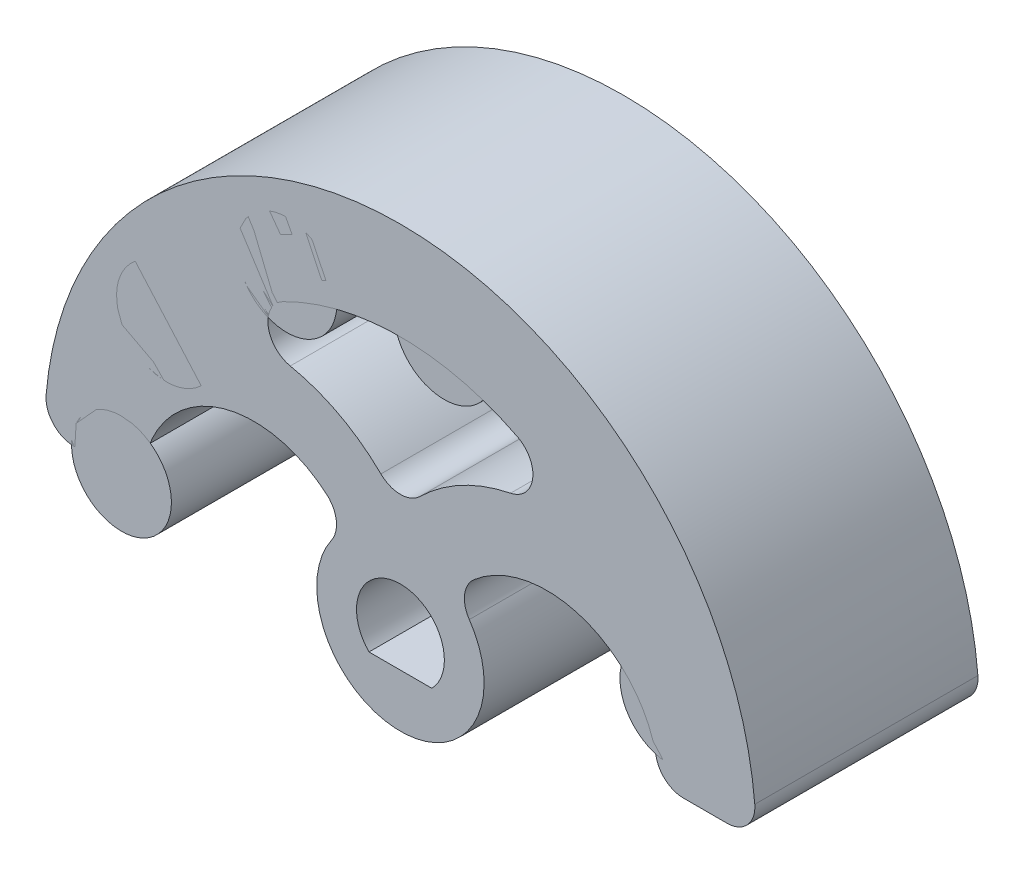
ISO-10303-21;
HEADER;
FILE_DESCRIPTION(('STEP AP214'),'2;1');
FILE_NAME('part.step','',(''),(''),'','','');
FILE_SCHEMA(('AUTOMOTIVE_DESIGN { 1 0 10303 214 1 1 1 1 }'));
ENDSEC;
DATA;
#1=APPLICATION_CONTEXT('core data for automotive mechanical design processes');
#2=APPLICATION_PROTOCOL_DEFINITION('international standard','automotive_design',2000,#1);
#3=PRODUCT_CONTEXT('',#1,'mechanical');
#4=PRODUCT('Part','Part','',(#3));
#5=PRODUCT_RELATED_PRODUCT_CATEGORY('part','',(#4));
#6=PRODUCT_DEFINITION_FORMATION('','',#4);
#7=PRODUCT_DEFINITION_CONTEXT('part definition',#1,'design');
#8=PRODUCT_DEFINITION('design','',#6,#7);
#9=PRODUCT_DEFINITION_SHAPE('','',#8);
#10=(LENGTH_UNIT() NAMED_UNIT(*) SI_UNIT(.MILLI.,.METRE.));
#11=(NAMED_UNIT(*) PLANE_ANGLE_UNIT() SI_UNIT($,.RADIAN.));
#12=(NAMED_UNIT(*) SI_UNIT($,.STERADIAN.) SOLID_ANGLE_UNIT());
#13=UNCERTAINTY_MEASURE_WITH_UNIT(LENGTH_MEASURE(1.E-05),#10,'distance_accuracy_value','');
#14=(GEOMETRIC_REPRESENTATION_CONTEXT(3) GLOBAL_UNCERTAINTY_ASSIGNED_CONTEXT((#13)) GLOBAL_UNIT_ASSIGNED_CONTEXT((#10,
#11,#12)) REPRESENTATION_CONTEXT('',''));
#15=CARTESIAN_POINT('',(0.,0.,0.));
#16=DIRECTION('',(0.,0.,1.));
#17=DIRECTION('',(1.,0.,0.));
#18=AXIS2_PLACEMENT_3D('',#15,#16,#17);
#19=CARTESIAN_POINT('',(9.6592582628907,2.58819045102516,0.));
#20=DIRECTION('',(0.,0.,1.));
#21=DIRECTION('',(-0.96592582628907,-0.258819045102516,0.));
#22=AXIS2_PLACEMENT_3D('',#19,#20,#21);
#23=CYLINDRICAL_SURFACE('',#22,1.78981093410736);
#24=CARTESIAN_POINT('',(9.6592582628907,2.58819045102516,0.));
#25=DIRECTION('',(0.,0.,1.));
#26=DIRECTION('',(-0.96592582628907,-0.258819045102516,0.));
#27=AXIS2_PLACEMENT_3D('',#24,#25,#26);
#28=CIRCLE('',#27,1.78981093410736);
#29=CARTESIAN_POINT('',(7.93043365746183,2.12495329414545,0.));
#30=VERTEX_POINT('',#29);
#31=EDGE_CURVE('P0_E11',#30,#30,#28,.T.);
#32=ORIENTED_EDGE('',*,*,#31,.T.);
#33=EDGE_LOOP('',(#32));
#34=FACE_BOUND('',#33,.T.);
#35=CARTESIAN_POINT('',(9.6592582628907,2.58819045102516,8.));
#36=DIRECTION('',(0.,0.,1.));
#37=DIRECTION('',(-0.96592582628907,-0.258819045102516,0.));
#38=AXIS2_PLACEMENT_3D('',#35,#36,#37);
#39=CIRCLE('',#38,1.78981093410736);
#40=CARTESIAN_POINT('',(7.93043365746183,2.12495329414545,8.));
#41=VERTEX_POINT('',#40);
#42=EDGE_CURVE('P0_E51',#41,#41,#39,.T.);
#43=ORIENTED_EDGE('',*,*,#42,.F.);
#44=EDGE_LOOP('',(#43));
#45=FACE_BOUND('',#44,.T.);
#46=ADVANCED_FACE('P0_F48',(#34,#45),#23,.T.);
#47=CARTESIAN_POINT('',(0.,0.,0.));
#48=DIRECTION('',(0.,0.,1.));
#49=DIRECTION('',(-0.96592582628907,-0.258819045102516,0.));
#50=AXIS2_PLACEMENT_3D('',#47,#48,#49);
#51=PLANE('',#50);
#52=ORIENTED_EDGE('',*,*,#31,.F.);
#53=EDGE_LOOP('',(#52));
#54=FACE_BOUND('',#53,.T.);
#55=ADVANCED_FACE('P0_F63',(#54),#51,.F.);
#56=CARTESIAN_POINT('',(0.,0.,8.));
#57=DIRECTION('',(0.,0.,1.));
#58=DIRECTION('',(-0.96592582628907,-0.258819045102516,0.));
#59=AXIS2_PLACEMENT_3D('',#56,#57,#58);
#60=PLANE('',#59);
#61=ORIENTED_EDGE('',*,*,#42,.T.);
#62=EDGE_LOOP('',(#61));
#63=FACE_BOUND('',#62,.T.);
#64=ADVANCED_FACE('P0_F60',(#63),#60,.T.);
#65=CLOSED_SHELL('',(#46,#55,#64));
#66=MANIFOLD_SOLID_BREP('P0_B2',#65);
#67=CARTESIAN_POINT('',(6.69130606358861,7.43144825477392,0.));
#68=DIRECTION('',(0.,0.,1.));
#69=DIRECTION('',(-0.669130606358861,-0.743144825477392,0.));
#70=AXIS2_PLACEMENT_3D('',#67,#68,#69);
#71=CYLINDRICAL_SURFACE('',#70,1.78981093410736);
#72=CARTESIAN_POINT('',(6.69130606358861,7.43144825477392,0.));
#73=DIRECTION('',(0.,0.,1.));
#74=DIRECTION('',(-0.669130606358861,-0.743144825477392,0.));
#75=AXIS2_PLACEMENT_3D('',#72,#73,#74);
#76=CIRCLE('',#75,1.78981093410736);
#77=CARTESIAN_POINT('',(5.49368878798163,6.10135952050917,0.));
#78=VERTEX_POINT('',#77);
#79=EDGE_CURVE('P0_E47',#78,#78,#76,.T.);
#80=ORIENTED_EDGE('',*,*,#79,.T.);
#81=EDGE_LOOP('',(#80));
#82=FACE_BOUND('',#81,.T.);
#83=CARTESIAN_POINT('',(6.69130606358861,7.43144825477392,8.));
#84=DIRECTION('',(0.,0.,1.));
#85=DIRECTION('',(-0.669130606358861,-0.743144825477392,0.));
#86=AXIS2_PLACEMENT_3D('',#83,#84,#85);
#87=CIRCLE('',#86,1.78981093410736);
#88=CARTESIAN_POINT('',(5.49368878798163,6.10135952050917,8.));
#89=VERTEX_POINT('',#88);
#90=EDGE_CURVE('P0_E128',#89,#89,#87,.T.);
#91=ORIENTED_EDGE('',*,*,#90,.F.);
#92=EDGE_LOOP('',(#91));
#93=FACE_BOUND('',#92,.T.);
#94=ADVANCED_FACE('P0_F125',(#82,#93),#71,.T.);
#95=CARTESIAN_POINT('',(0.,0.,0.));
#96=DIRECTION('',(0.,0.,1.));
#97=DIRECTION('',(-0.669130606358861,-0.743144825477392,0.));
#98=AXIS2_PLACEMENT_3D('',#95,#96,#97);
#99=PLANE('',#98);
#100=ORIENTED_EDGE('',*,*,#79,.F.);
#101=EDGE_LOOP('',(#100));
#102=FACE_BOUND('',#101,.T.);
#103=ADVANCED_FACE('P0_F140',(#102),#99,.F.);
#104=CARTESIAN_POINT('',(0.,0.,8.));
#105=DIRECTION('',(0.,0.,1.));
#106=DIRECTION('',(-0.669130606358861,-0.743144825477392,0.));
#107=AXIS2_PLACEMENT_3D('',#104,#105,#106);
#108=PLANE('',#107);
#109=ORIENTED_EDGE('',*,*,#90,.T.);
#110=EDGE_LOOP('',(#109));
#111=FACE_BOUND('',#110,.T.);
#112=ADVANCED_FACE('P0_F137',(#111),#108,.T.);
#113=CLOSED_SHELL('',(#94,#103,#112));
#114=MANIFOLD_SOLID_BREP('P0_B6',#113);
#115=CARTESIAN_POINT('',(1.56434465040234,9.87688340595137,0.));
#116=DIRECTION('',(0.,0.,1.));
#117=DIRECTION('',(-0.156434465040234,-0.987688340595137,0.));
#118=AXIS2_PLACEMENT_3D('',#115,#116,#117);
#119=CYLINDRICAL_SURFACE('',#118,1.78981093410736);
#120=CARTESIAN_POINT('',(1.56434465040234,9.87688340595137,0.));
#121=DIRECTION('',(0.,0.,1.));
#122=DIRECTION('',(-0.156434465040234,-0.987688340595137,0.));
#123=AXIS2_PLACEMENT_3D('',#120,#121,#122);
#124=CIRCLE('',#123,1.78981093410736);
#125=CARTESIAN_POINT('',(1.28435653440209,8.10910801446384,0.));
#126=VERTEX_POINT('',#125);
#127=EDGE_CURVE('P0_E124',#126,#126,#124,.T.);
#128=ORIENTED_EDGE('',*,*,#127,.T.);
#129=EDGE_LOOP('',(#128));
#130=FACE_BOUND('',#129,.T.);
#131=CARTESIAN_POINT('',(1.56434465040234,9.87688340595137,8.));
#132=DIRECTION('',(0.,0.,1.));
#133=DIRECTION('',(-0.156434465040234,-0.987688340595137,0.));
#134=AXIS2_PLACEMENT_3D('',#131,#132,#133);
#135=CIRCLE('',#134,1.78981093410736);
#136=CARTESIAN_POINT('',(1.28435653440209,8.10910801446384,8.));
#137=VERTEX_POINT('',#136);
#138=EDGE_CURVE('P0_E205',#137,#137,#135,.T.);
#139=ORIENTED_EDGE('',*,*,#138,.F.);
#140=EDGE_LOOP('',(#139));
#141=FACE_BOUND('',#140,.T.);
#142=ADVANCED_FACE('P0_F202',(#130,#141),#119,.T.);
#143=CARTESIAN_POINT('',(0.,0.,0.));
#144=DIRECTION('',(0.,0.,1.));
#145=DIRECTION('',(-0.156434465040234,-0.987688340595137,0.));
#146=AXIS2_PLACEMENT_3D('',#143,#144,#145);
#147=PLANE('',#146);
#148=ORIENTED_EDGE('',*,*,#127,.F.);
#149=EDGE_LOOP('',(#148));
#150=FACE_BOUND('',#149,.T.);
#151=ADVANCED_FACE('P0_F217',(#150),#147,.F.);
#152=CARTESIAN_POINT('',(0.,0.,8.));
#153=DIRECTION('',(0.,0.,1.));
#154=DIRECTION('',(-0.156434465040234,-0.987688340595137,0.));
#155=AXIS2_PLACEMENT_3D('',#152,#153,#154);
#156=PLANE('',#155);
#157=ORIENTED_EDGE('',*,*,#138,.T.);
#158=EDGE_LOOP('',(#157));
#159=FACE_BOUND('',#158,.T.);
#160=ADVANCED_FACE('P0_F214',(#159),#156,.T.);
#161=CLOSED_SHELL('',(#142,#151,#160));
#162=MANIFOLD_SOLID_BREP('P0_B42',#161);
#163=CARTESIAN_POINT('',(-4.06736643075798,9.13545457642602,0.));
#164=DIRECTION('',(0.,0.,1.));
#165=DIRECTION('',(0.406736643075798,-0.913545457642602,0.));
#166=AXIS2_PLACEMENT_3D('',#163,#164,#165);
#167=CYLINDRICAL_SURFACE('',#166,1.78981093410736);
#168=CARTESIAN_POINT('',(-4.06736643075798,9.13545457642602,0.));
#169=DIRECTION('',(0.,0.,1.));
#170=DIRECTION('',(0.406736643075798,-0.913545457642602,0.));
#171=AXIS2_PLACEMENT_3D('',#168,#169,#170);
#172=CIRCLE('',#171,1.78981093410736);
#173=CARTESIAN_POINT('',(-3.3393847396788,7.50038092753317,0.));
#174=VERTEX_POINT('',#173);
#175=EDGE_CURVE('P0_E201',#174,#174,#172,.T.);
#176=ORIENTED_EDGE('',*,*,#175,.T.);
#177=EDGE_LOOP('',(#176));
#178=FACE_BOUND('',#177,.T.);
#179=CARTESIAN_POINT('',(-4.06736643075798,9.13545457642602,8.));
#180=DIRECTION('',(0.,0.,1.));
#181=DIRECTION('',(0.406736643075798,-0.913545457642602,0.));
#182=AXIS2_PLACEMENT_3D('',#179,#180,#181);
#183=CIRCLE('',#182,1.78981093410736);
#184=CARTESIAN_POINT('',(-3.3393847396788,7.50038092753317,8.));
#185=VERTEX_POINT('',#184);
#186=EDGE_CURVE('P0_E282',#185,#185,#183,.T.);
#187=ORIENTED_EDGE('',*,*,#186,.F.);
#188=EDGE_LOOP('',(#187));
#189=FACE_BOUND('',#188,.T.);
#190=ADVANCED_FACE('P0_F279',(#178,#189),#167,.T.);
#191=CARTESIAN_POINT('',(0.,0.,0.));
#192=DIRECTION('',(0.,0.,1.));
#193=DIRECTION('',(0.406736643075798,-0.913545457642602,0.));
#194=AXIS2_PLACEMENT_3D('',#191,#192,#193);
#195=PLANE('',#194);
#196=ORIENTED_EDGE('',*,*,#175,.F.);
#197=EDGE_LOOP('',(#196));
#198=FACE_BOUND('',#197,.T.);
#199=ADVANCED_FACE('P0_F294',(#198),#195,.F.);
#200=CARTESIAN_POINT('',(0.,0.,8.));
#201=DIRECTION('',(0.,0.,1.));
#202=DIRECTION('',(0.406736643075798,-0.913545457642602,0.));
#203=AXIS2_PLACEMENT_3D('',#200,#201,#202);
#204=PLANE('',#203);
#205=ORIENTED_EDGE('',*,*,#186,.T.);
#206=EDGE_LOOP('',(#205));
#207=FACE_BOUND('',#206,.T.);
#208=ADVANCED_FACE('P0_F291',(#207),#204,.T.);
#209=CLOSED_SHELL('',(#190,#199,#208));
#210=MANIFOLD_SOLID_BREP('P0_B119',#209);
#211=CARTESIAN_POINT('',(-8.38670567945424,5.44639035015028,0.));
#212=DIRECTION('',(0.,0.,1.));
#213=DIRECTION('',(0.838670567945423,-0.544639035015028,0.));
#214=AXIS2_PLACEMENT_3D('',#211,#212,#213);
#215=CYLINDRICAL_SURFACE('',#214,1.78981093410736);
#216=CARTESIAN_POINT('',(-8.38670567945424,5.44639035015028,0.));
#217=DIRECTION('',(0.,0.,1.));
#218=DIRECTION('',(0.838670567945423,-0.544639035015028,0.));
#219=AXIS2_PLACEMENT_3D('',#216,#217,#218);
#220=CIRCLE('',#219,1.78981093410736);
#221=CARTESIAN_POINT('',(-6.88564392683148,4.4715894501387,0.));
#222=VERTEX_POINT('',#221);
#223=EDGE_CURVE('P0_E278',#222,#222,#220,.T.);
#224=ORIENTED_EDGE('',*,*,#223,.T.);
#225=EDGE_LOOP('',(#224));
#226=FACE_BOUND('',#225,.T.);
#227=CARTESIAN_POINT('',(-8.38670567945424,5.44639035015028,8.));
#228=DIRECTION('',(0.,0.,1.));
#229=DIRECTION('',(0.838670567945423,-0.544639035015028,0.));
#230=AXIS2_PLACEMENT_3D('',#227,#228,#229);
#231=CIRCLE('',#230,1.78981093410736);
#232=CARTESIAN_POINT('',(-6.88564392683148,4.4715894501387,8.));
#233=VERTEX_POINT('',#232);
#234=EDGE_CURVE('P0_E358',#233,#233,#231,.T.);
#235=ORIENTED_EDGE('',*,*,#234,.F.);
#236=EDGE_LOOP('',(#235));
#237=FACE_BOUND('',#236,.T.);
#238=ADVANCED_FACE('P0_F355',(#226,#237),#215,.T.);
#239=CARTESIAN_POINT('',(0.,0.,0.));
#240=DIRECTION('',(0.,0.,1.));
#241=DIRECTION('',(0.838670567945423,-0.544639035015028,0.));
#242=AXIS2_PLACEMENT_3D('',#239,#240,#241);
#243=PLANE('',#242);
#244=ORIENTED_EDGE('',*,*,#223,.F.);
#245=EDGE_LOOP('',(#244));
#246=FACE_BOUND('',#245,.T.);
#247=ADVANCED_FACE('P0_F370',(#246),#243,.F.);
#248=CARTESIAN_POINT('',(0.,0.,8.));
#249=DIRECTION('',(0.,0.,1.));
#250=DIRECTION('',(0.838670567945423,-0.544639035015028,0.));
#251=AXIS2_PLACEMENT_3D('',#248,#249,#250);
#252=PLANE('',#251);
#253=ORIENTED_EDGE('',*,*,#234,.T.);
#254=EDGE_LOOP('',(#253));
#255=FACE_BOUND('',#254,.T.);
#256=ADVANCED_FACE('P0_F367',(#255),#252,.T.);
#257=CLOSED_SHELL('',(#238,#247,#256));
#258=MANIFOLD_SOLID_BREP('P0_B196',#257);
#259=CARTESIAN_POINT('',(-10.,0.,0.));
#260=DIRECTION('',(0.,0.,1.));
#261=DIRECTION('',(1.,0.,0.));
#262=AXIS2_PLACEMENT_3D('',#259,#260,#261);
#263=CYLINDRICAL_SURFACE('',#262,1.78981093410736);
#264=CARTESIAN_POINT('',(-10.,0.,0.));
#265=DIRECTION('',(0.,0.,1.));
#266=DIRECTION('',(1.,0.,0.));
#267=AXIS2_PLACEMENT_3D('',#264,#265,#266);
#268=CIRCLE('',#267,1.78981093410736);
#269=CARTESIAN_POINT('',(-8.21018906589264,0.,0.));
#270=VERTEX_POINT('',#269);
#271=EDGE_CURVE('P0_E354',#270,#270,#268,.T.);
#272=ORIENTED_EDGE('',*,*,#271,.T.);
#273=EDGE_LOOP('',(#272));
#274=FACE_BOUND('',#273,.T.);
#275=CARTESIAN_POINT('',(-10.,0.,8.));
#276=DIRECTION('',(0.,0.,1.));
#277=DIRECTION('',(1.,0.,0.));
#278=AXIS2_PLACEMENT_3D('',#275,#276,#277);
#279=CIRCLE('',#278,1.78981093410736);
#280=CARTESIAN_POINT('',(-8.21018906589264,0.,8.));
#281=VERTEX_POINT('',#280);
#282=EDGE_CURVE('P0_E427',#281,#281,#279,.T.);
#283=ORIENTED_EDGE('',*,*,#282,.F.);
#284=EDGE_LOOP('',(#283));
#285=FACE_BOUND('',#284,.T.);
#286=ADVANCED_FACE('P0_F424',(#274,#285),#263,.T.);
#287=CARTESIAN_POINT('',(0.,0.,0.));
#288=DIRECTION('',(0.,0.,1.));
#289=DIRECTION('',(1.,0.,0.));
#290=AXIS2_PLACEMENT_3D('',#287,#288,#289);
#291=PLANE('',#290);
#292=ORIENTED_EDGE('',*,*,#271,.F.);
#293=EDGE_LOOP('',(#292));
#294=FACE_BOUND('',#293,.T.);
#295=ADVANCED_FACE('P0_F439',(#294),#291,.F.);
#296=CARTESIAN_POINT('',(0.,0.,8.));
#297=DIRECTION('',(0.,0.,1.));
#298=DIRECTION('',(1.,0.,0.));
#299=AXIS2_PLACEMENT_3D('',#296,#297,#298);
#300=PLANE('',#299);
#301=ORIENTED_EDGE('',*,*,#282,.T.);
#302=EDGE_LOOP('',(#301));
#303=FACE_BOUND('',#302,.T.);
#304=ADVANCED_FACE('P0_F436',(#303),#300,.T.);
#305=CLOSED_SHELL('',(#286,#295,#304));
#306=MANIFOLD_SOLID_BREP('P0_B273',#305);
#307=CARTESIAN_POINT('',(11.7073694739681,1.,8.));
#308=DIRECTION('',(0.,0.,1.));
#309=DIRECTION('',(1.,0.,0.));
#310=AXIS2_PLACEMENT_3D('',#307,#308,#309);
#311=CYLINDRICAL_SURFACE('',#310,1.);
#312=CARTESIAN_POINT('',(11.7073694739681,1.,8.));
#313=DIRECTION('',(0.,0.,-1.));
#314=DIRECTION('',(0.,-1.,0.));
#315=AXIS2_PLACEMENT_3D('',#312,#313,#314);
#316=CIRCLE('',#315,1.);
#317=CARTESIAN_POINT('',(12.703741344093,1.08510638297872,8.));
#318=VERTEX_POINT('',#317);
#319=CARTESIAN_POINT('',(11.7073694739681,0.,8.));
#320=VERTEX_POINT('',#319);
#321=EDGE_CURVE('P1_E11',#318,#320,#316,.T.);
#322=ORIENTED_EDGE('',*,*,#321,.T.);
#323=DIRECTION('',(0.,0.,-1.));
#324=VECTOR('',#323,1.);
#325=CARTESIAN_POINT('',(11.7073694739681,0.,8.));
#326=LINE('',#325,#324);
#327=CARTESIAN_POINT('',(11.7073694739681,0.,0.));
#328=VERTEX_POINT('',#327);
#329=EDGE_CURVE('P1_E27',#320,#328,#326,.T.);
#330=ORIENTED_EDGE('',*,*,#329,.T.);
#331=CARTESIAN_POINT('',(11.7073694739681,1.,0.));
#332=DIRECTION('',(0.,0.,1.));
#333=DIRECTION('',(1.,0.,0.));
#334=AXIS2_PLACEMENT_3D('',#331,#332,#333);
#335=CIRCLE('',#334,1.);
#336=CARTESIAN_POINT('',(12.703741344093,1.08510638297872,0.));
#337=VERTEX_POINT('',#336);
#338=EDGE_CURVE('P1_E325',#328,#337,#335,.T.);
#339=ORIENTED_EDGE('',*,*,#338,.T.);
#340=DIRECTION('',(0.,0.,1.));
#341=VECTOR('',#340,1.);
#342=CARTESIAN_POINT('',(12.703741344093,1.08510638297872,8.));
#343=LINE('',#342,#341);
#344=EDGE_CURVE('P1_E326',#337,#318,#343,.T.);
#345=ORIENTED_EDGE('',*,*,#344,.T.);
#346=EDGE_LOOP('',(#322,#330,#339,#345));
#347=FACE_BOUND('',#346,.T.);
#348=ADVANCED_FACE('P1_F17',(#347),#311,.T.);
#349=CARTESIAN_POINT('',(0.,0.,8.));
#350=DIRECTION('',(0.,0.,-1.));
#351=DIRECTION('',(0.,-1.,0.));
#352=AXIS2_PLACEMENT_3D('',#349,#350,#351);
#353=CYLINDRICAL_SURFACE('',#352,12.75);
#354=ORIENTED_EDGE('',*,*,#344,.F.);
#355=CARTESIAN_POINT('',(0.,0.,0.));
#356=DIRECTION('',(0.,0.,-1.));
#357=DIRECTION('',(0.,-1.,0.));
#358=AXIS2_PLACEMENT_3D('',#355,#356,#357);
#359=CIRCLE('',#358,12.75);
#360=CARTESIAN_POINT('',(-12.703741344093,1.08510638297872,0.));
#361=VERTEX_POINT('',#360);
#362=EDGE_CURVE('P1_E208',#361,#337,#359,.T.);
#363=ORIENTED_EDGE('',*,*,#362,.F.);
#364=DIRECTION('',(0.,0.,-1.));
#365=VECTOR('',#364,1.);
#366=CARTESIAN_POINT('',(-12.703741344093,1.08510638297872,8.));
#367=LINE('',#366,#365);
#368=CARTESIAN_POINT('',(-12.703741344093,1.08510638297872,8.));
#369=VERTEX_POINT('',#368);
#370=EDGE_CURVE('P1_E243',#369,#361,#367,.T.);
#371=ORIENTED_EDGE('',*,*,#370,.F.);
#372=CARTESIAN_POINT('',(0.,0.,8.));
#373=DIRECTION('',(0.,0.,1.));
#374=DIRECTION('',(0.,-1.,0.));
#375=AXIS2_PLACEMENT_3D('',#372,#373,#374);
#376=CIRCLE('',#375,12.75);
#377=EDGE_CURVE('P1_E304',#318,#369,#376,.T.);
#378=ORIENTED_EDGE('',*,*,#377,.F.);
#379=EDGE_LOOP('',(#354,#363,#371,#378));
#380=FACE_BOUND('',#379,.T.);
#381=ADVANCED_FACE('P1_F338',(#380),#353,.T.);
#382=CARTESIAN_POINT('',(0.,0.,0.));
#383=DIRECTION('',(0.,0.,1.));
#384=DIRECTION('',(1.,0.,0.));
#385=AXIS2_PLACEMENT_3D('',#382,#383,#384);
#386=PLANE('',#385);
#387=ORIENTED_EDGE('',*,*,#338,.F.);
#388=DIRECTION('',(-1.,0.,0.));
#389=VECTOR('',#388,1.);
#390=CARTESIAN_POINT('',(9.25,0.,0.));
#391=LINE('',#390,#389);
#392=CARTESIAN_POINT('',(10.1489794855664,0.,0.));
#393=VERTEX_POINT('',#392);
#394=EDGE_CURVE('P1_E183',#328,#393,#391,.T.);
#395=ORIENTED_EDGE('',*,*,#394,.T.);
#396=CARTESIAN_POINT('',(10.1489794855664,1.,0.));
#397=DIRECTION('',(0.,0.,1.));
#398=DIRECTION('',(1.,0.,0.));
#399=AXIS2_PLACEMENT_3D('',#396,#397,#398);
#400=CIRCLE('',#399,1.);
#401=CARTESIAN_POINT('',(9.16918358845309,0.800000000000001,0.));
#402=VERTEX_POINT('',#401);
#403=EDGE_CURVE('P1_E174',#402,#393,#400,.T.);
#404=ORIENTED_EDGE('',*,*,#403,.F.);
#405=CARTESIAN_POINT('',(5.25,0.,0.));
#406=DIRECTION('',(0.,0.,1.));
#407=DIRECTION('',(1.,0.,0.));
#408=AXIS2_PLACEMENT_3D('',#405,#406,#407);
#409=CIRCLE('',#408,4.);
#410=CARTESIAN_POINT('',(2.63888888888889,3.03019780962103,0.));
#411=VERTEX_POINT('',#410);
#412=EDGE_CURVE('P1_E185',#402,#411,#409,.T.);
#413=ORIENTED_EDGE('',*,*,#412,.T.);
#414=CARTESIAN_POINT('',(3.29166666666667,2.27264835721577,0.));
#415=DIRECTION('',(0.,0.,-1.));
#416=DIRECTION('',(0.,-1.,0.));
#417=AXIS2_PLACEMENT_3D('',#414,#415,#416);
#418=CIRCLE('',#417,1.);
#419=CARTESIAN_POINT('',(2.46875,1.70448626791183,0.));
#420=VERTEX_POINT('',#419);
#421=EDGE_CURVE('P1_E189',#420,#411,#418,.T.);
#422=ORIENTED_EDGE('',*,*,#421,.F.);
#423=CARTESIAN_POINT('',(0.,0.,0.));
#424=DIRECTION('',(0.,0.,-1.));
#425=DIRECTION('',(0.,-1.,0.));
#426=AXIS2_PLACEMENT_3D('',#423,#424,#425);
#427=CIRCLE('',#426,3.);
#428=CARTESIAN_POINT('',(-2.46875,1.70448626791183,0.));
#429=VERTEX_POINT('',#428);
#430=EDGE_CURVE('P1_E188',#420,#429,#427,.T.);
#431=ORIENTED_EDGE('',*,*,#430,.T.);
#432=CARTESIAN_POINT('',(-3.29166666666667,2.27264835721577,0.));
#433=DIRECTION('',(0.,0.,-1.));
#434=DIRECTION('',(0.,-1.,0.));
#435=AXIS2_PLACEMENT_3D('',#432,#433,#434);
#436=CIRCLE('',#435,1.);
#437=CARTESIAN_POINT('',(-2.63888888888889,3.03019780962103,0.));
#438=VERTEX_POINT('',#437);
#439=EDGE_CURVE('P1_E196',#438,#429,#436,.T.);
#440=ORIENTED_EDGE('',*,*,#439,.F.);
#441=CARTESIAN_POINT('',(-5.25,0.,0.));
#442=DIRECTION('',(0.,0.,1.));
#443=DIRECTION('',(1.,0.,0.));
#444=AXIS2_PLACEMENT_3D('',#441,#442,#443);
#445=CIRCLE('',#444,4.);
#446=CARTESIAN_POINT('',(-9.16918358845309,0.8,0.));
#447=VERTEX_POINT('',#446);
#448=EDGE_CURVE('P1_E195',#438,#447,#445,.T.);
#449=ORIENTED_EDGE('',*,*,#448,.T.);
#450=CARTESIAN_POINT('',(-10.1489794855664,1.,0.));
#451=DIRECTION('',(0.,0.,1.));
#452=DIRECTION('',(1.,0.,0.));
#453=AXIS2_PLACEMENT_3D('',#450,#451,#452);
#454=CIRCLE('',#453,1.);
#455=CARTESIAN_POINT('',(-10.1489794855664,0.,0.));
#456=VERTEX_POINT('',#455);
#457=EDGE_CURVE('P1_E202',#456,#447,#454,.T.);
#458=ORIENTED_EDGE('',*,*,#457,.F.);
#459=DIRECTION('',(-1.,0.,0.));
#460=VECTOR('',#459,1.);
#461=CARTESIAN_POINT('',(-11.75,0.,0.));
#462=LINE('',#461,#460);
#463=CARTESIAN_POINT('',(-11.7073694739681,0.,0.));
#464=VERTEX_POINT('',#463);
#465=EDGE_CURVE('P1_E201',#456,#464,#462,.T.);
#466=ORIENTED_EDGE('',*,*,#465,.T.);
#467=CARTESIAN_POINT('',(-11.7073694739681,0.999999999999999,0.));
#468=DIRECTION('',(0.,0.,1.));
#469=DIRECTION('',(1.,0.,0.));
#470=AXIS2_PLACEMENT_3D('',#467,#468,#469);
#471=CIRCLE('',#470,1.);
#472=EDGE_CURVE('P1_E209',#361,#464,#471,.T.);
#473=ORIENTED_EDGE('',*,*,#472,.F.);
#474=ORIENTED_EDGE('',*,*,#362,.T.);
#475=EDGE_LOOP('',(#387,#395,#404,#413,#422,#431,#440,#449,#458,#466,#473,#474));
#476=FACE_BOUND('',#475,.T.);
#477=CARTESIAN_POINT('',(5.25,0.,0.));
#478=DIRECTION('',(0.,0.,-1.));
#479=DIRECTION('',(0.,-1.,0.));
#480=AXIS2_PLACEMENT_3D('',#477,#478,#479);
#481=CIRCLE('',#480,6.5);
#482=CARTESIAN_POINT('',(0.700000000000001,4.64192847855285,0.));
#483=VERTEX_POINT('',#482);
#484=CARTESIAN_POINT('',(3.95,6.36867333123626,0.));
#485=VERTEX_POINT('',#484);
#486=EDGE_CURVE('P1_E213',#483,#485,#481,.T.);
#487=ORIENTED_EDGE('',*,*,#486,.T.);
#488=CARTESIAN_POINT('',(3.75,7.34846922834953,0.));
#489=DIRECTION('',(0.,0.,-1.));
#490=DIRECTION('',(0.,-1.,0.));
#491=AXIS2_PLACEMENT_3D('',#488,#489,#490);
#492=CIRCLE('',#491,1.);
#493=CARTESIAN_POINT('',(4.20454545454546,8.23919277117978,0.));
#494=VERTEX_POINT('',#493);
#495=EDGE_CURVE('P1_E217',#494,#485,#492,.T.);
#496=ORIENTED_EDGE('',*,*,#495,.F.);
#497=CARTESIAN_POINT('',(0.,0.,0.));
#498=DIRECTION('',(0.,0.,1.));
#499=DIRECTION('',(1.,0.,0.));
#500=AXIS2_PLACEMENT_3D('',#497,#498,#499);
#501=CIRCLE('',#500,9.25);
#502=CARTESIAN_POINT('',(-4.20454545454546,8.23919277117978,0.));
#503=VERTEX_POINT('',#502);
#504=EDGE_CURVE('P1_E216',#494,#503,#501,.T.);
#505=ORIENTED_EDGE('',*,*,#504,.T.);
#506=CARTESIAN_POINT('',(-3.75,7.34846922834953,0.));
#507=DIRECTION('',(0.,0.,-1.));
#508=DIRECTION('',(0.,-1.,0.));
#509=AXIS2_PLACEMENT_3D('',#506,#507,#508);
#510=CIRCLE('',#509,1.);
#511=CARTESIAN_POINT('',(-3.95,6.36867333123626,0.));
#512=VERTEX_POINT('',#511);
#513=EDGE_CURVE('P1_E224',#512,#503,#510,.T.);
#514=ORIENTED_EDGE('',*,*,#513,.F.);
#515=CARTESIAN_POINT('',(-5.25,0.,0.));
#516=DIRECTION('',(0.,0.,-1.));
#517=DIRECTION('',(0.,-1.,0.));
#518=AXIS2_PLACEMENT_3D('',#515,#516,#517);
#519=CIRCLE('',#518,6.5);
#520=CARTESIAN_POINT('',(-0.7,4.64192847855285,0.));
#521=VERTEX_POINT('',#520);
#522=EDGE_CURVE('P1_E223',#512,#521,#519,.T.);
#523=ORIENTED_EDGE('',*,*,#522,.T.);
#524=CARTESIAN_POINT('',(0.,5.35607132140714,0.));
#525=DIRECTION('',(0.,0.,-1.));
#526=DIRECTION('',(0.,-1.,0.));
#527=AXIS2_PLACEMENT_3D('',#524,#525,#526);
#528=CIRCLE('',#527,1.);
#529=EDGE_CURVE('P1_E231',#483,#521,#528,.T.);
#530=ORIENTED_EDGE('',*,*,#529,.F.);
#531=EDGE_LOOP('',(#487,#496,#505,#514,#523,#530));
#532=FACE_BOUND('',#531,.T.);
#533=CARTESIAN_POINT('',(0.,0.,0.));
#534=DIRECTION('',(0.,0.,1.));
#535=DIRECTION('',(1.,0.,0.));
#536=AXIS2_PLACEMENT_3D('',#533,#534,#535);
#537=CIRCLE('',#536,1.575);
#538=CARTESIAN_POINT('',(1.12722003175955,-1.1,0.));
#539=VERTEX_POINT('',#538);
#540=CARTESIAN_POINT('',(-1.12722003175955,-1.1,0.));
#541=VERTEX_POINT('',#540);
#542=EDGE_CURVE('P1_E230',#539,#541,#537,.T.);
#543=ORIENTED_EDGE('',*,*,#542,.T.);
#544=DIRECTION('',(1.,0.,0.));
#545=VECTOR('',#544,1.);
#546=CARTESIAN_POINT('',(1.12722003175955,-1.1,0.));
#547=LINE('',#546,#545);
#548=EDGE_CURVE('P1_E211',#541,#539,#547,.T.);
#549=ORIENTED_EDGE('',*,*,#548,.T.);
#550=EDGE_LOOP('',(#543,#549));
#551=FACE_BOUND('',#550,.T.);
#552=ADVANCED_FACE('P1_F321',(#476,#532,#551),#386,.F.);
#553=CARTESIAN_POINT('',(-11.7073694739681,0.999999999999999,8.));
#554=DIRECTION('',(0.,0.,-1.));
#555=DIRECTION('',(0.,-1.,0.));
#556=AXIS2_PLACEMENT_3D('',#553,#554,#555);
#557=CYLINDRICAL_SURFACE('',#556,1.);
#558=ORIENTED_EDGE('',*,*,#472,.T.);
#559=DIRECTION('',(0.,0.,1.));
#560=VECTOR('',#559,1.);
#561=CARTESIAN_POINT('',(-11.7073694739681,0.,8.));
#562=LINE('',#561,#560);
#563=CARTESIAN_POINT('',(-11.7073694739681,0.,8.));
#564=VERTEX_POINT('',#563);
#565=EDGE_CURVE('P1_E212',#464,#564,#562,.T.);
#566=ORIENTED_EDGE('',*,*,#565,.T.);
#567=CARTESIAN_POINT('',(-11.7073694739681,0.999999999999999,8.));
#568=DIRECTION('',(0.,0.,-1.));
#569=DIRECTION('',(0.,-1.,0.));
#570=AXIS2_PLACEMENT_3D('',#567,#568,#569);
#571=CIRCLE('',#570,1.);
#572=EDGE_CURVE('P1_E240',#564,#369,#571,.T.);
#573=ORIENTED_EDGE('',*,*,#572,.T.);
#574=ORIENTED_EDGE('',*,*,#370,.T.);
#575=EDGE_LOOP('',(#558,#566,#573,#574));
#576=FACE_BOUND('',#575,.T.);
#577=ADVANCED_FACE('P1_F341',(#576),#557,.T.);
#578=CARTESIAN_POINT('',(-1.12722003175955,-1.1,8.));
#579=DIRECTION('',(0.,1.,0.));
#580=DIRECTION('',(0.,0.,1.));
#581=AXIS2_PLACEMENT_3D('',#578,#579,#580);
#582=PLANE('',#581);
#583=DIRECTION('',(-1.,0.,0.));
#584=VECTOR('',#583,1.);
#585=CARTESIAN_POINT('',(1.12722003175955,-1.1,8.));
#586=LINE('',#585,#584);
#587=CARTESIAN_POINT('',(1.12722003175955,-1.1,8.));
#588=VERTEX_POINT('',#587);
#589=CARTESIAN_POINT('',(-1.12722003175955,-1.1,8.));
#590=VERTEX_POINT('',#589);
#591=EDGE_CURVE('P1_E244',#588,#590,#586,.T.);
#592=ORIENTED_EDGE('',*,*,#591,.F.);
#593=DIRECTION('',(0.,0.,1.));
#594=VECTOR('',#593,1.);
#595=CARTESIAN_POINT('',(1.12722003175955,-1.1,0.));
#596=LINE('',#595,#594);
#597=EDGE_CURVE('P1_E247',#539,#588,#596,.T.);
#598=ORIENTED_EDGE('',*,*,#597,.F.);
#599=ORIENTED_EDGE('',*,*,#548,.F.);
#600=DIRECTION('',(0.,0.,-1.));
#601=VECTOR('',#600,1.);
#602=CARTESIAN_POINT('',(-1.12722003175955,-1.1,0.));
#603=LINE('',#602,#601);
#604=EDGE_CURVE('P1_E250',#590,#541,#603,.T.);
#605=ORIENTED_EDGE('',*,*,#604,.F.);
#606=EDGE_LOOP('',(#592,#598,#599,#605));
#607=FACE_BOUND('',#606,.T.);
#608=ADVANCED_FACE('P1_F382',(#607),#582,.T.);
#609=CARTESIAN_POINT('',(0.,0.,0.));
#610=DIRECTION('',(0.,0.,1.));
#611=DIRECTION('',(1.,0.,0.));
#612=AXIS2_PLACEMENT_3D('',#609,#610,#611);
#613=CYLINDRICAL_SURFACE('',#612,1.575);
#614=ORIENTED_EDGE('',*,*,#597,.T.);
#615=CARTESIAN_POINT('',(0.,0.,8.));
#616=DIRECTION('',(0.,0.,-1.));
#617=DIRECTION('',(0.,-1.,0.));
#618=AXIS2_PLACEMENT_3D('',#615,#616,#617);
#619=CIRCLE('',#618,1.575);
#620=EDGE_CURVE('P1_E172',#590,#588,#619,.T.);
#621=ORIENTED_EDGE('',*,*,#620,.F.);
#622=ORIENTED_EDGE('',*,*,#604,.T.);
#623=ORIENTED_EDGE('',*,*,#542,.F.);
#624=EDGE_LOOP('',(#614,#621,#622,#623));
#625=FACE_BOUND('',#624,.T.);
#626=ADVANCED_FACE('P1_F379',(#625),#613,.F.);
#627=CARTESIAN_POINT('',(3.75,7.34846922834953,8.));
#628=DIRECTION('',(0.,0.,-1.));
#629=DIRECTION('',(0.,-1.,0.));
#630=AXIS2_PLACEMENT_3D('',#627,#628,#629);
#631=CYLINDRICAL_SURFACE('',#630,1.);
#632=CARTESIAN_POINT('',(3.75,7.34846922834953,8.));
#633=DIRECTION('',(0.,0.,1.));
#634=DIRECTION('',(1.,0.,0.));
#635=AXIS2_PLACEMENT_3D('',#632,#633,#634);
#636=CIRCLE('',#635,1.);
#637=CARTESIAN_POINT('',(3.95,6.36867333123626,8.));
#638=VERTEX_POINT('',#637);
#639=CARTESIAN_POINT('',(4.20454545454546,8.23919277117978,8.));
#640=VERTEX_POINT('',#639);
#641=EDGE_CURVE('P1_E253',#638,#640,#636,.T.);
#642=ORIENTED_EDGE('',*,*,#641,.T.);
#643=DIRECTION('',(0.,0.,-1.));
#644=VECTOR('',#643,1.);
#645=CARTESIAN_POINT('',(4.20454545454546,8.23919277117978,8.));
#646=LINE('',#645,#644);
#647=EDGE_CURVE('P1_E219',#640,#494,#646,.T.);
#648=ORIENTED_EDGE('',*,*,#647,.T.);
#649=ORIENTED_EDGE('',*,*,#495,.T.);
#650=DIRECTION('',(0.,0.,1.));
#651=VECTOR('',#650,1.);
#652=CARTESIAN_POINT('',(3.95,6.36867333123626,8.));
#653=LINE('',#652,#651);
#654=EDGE_CURVE('P1_E220',#485,#638,#653,.T.);
#655=ORIENTED_EDGE('',*,*,#654,.T.);
#656=EDGE_LOOP('',(#642,#648,#649,#655));
#657=FACE_BOUND('',#656,.T.);
#658=ADVANCED_FACE('P1_F381',(#657),#631,.F.);
#659=CARTESIAN_POINT('',(0.,0.,8.));
#660=DIRECTION('',(0.,0.,-1.));
#661=DIRECTION('',(0.,-1.,0.));
#662=AXIS2_PLACEMENT_3D('',#659,#660,#661);
#663=CYLINDRICAL_SURFACE('',#662,9.25);
#664=ORIENTED_EDGE('',*,*,#647,.F.);
#665=CARTESIAN_POINT('',(0.,0.,8.));
#666=DIRECTION('',(0.,0.,-1.));
#667=DIRECTION('',(0.,-1.,0.));
#668=AXIS2_PLACEMENT_3D('',#665,#666,#667);
#669=CIRCLE('',#668,9.25);
#670=CARTESIAN_POINT('',(-4.20454545454546,8.23919277117978,8.));
#671=VERTEX_POINT('',#670);
#672=EDGE_CURVE('P1_E176',#671,#640,#669,.T.);
#673=ORIENTED_EDGE('',*,*,#672,.F.);
#674=DIRECTION('',(0.,0.,1.));
#675=VECTOR('',#674,1.);
#676=CARTESIAN_POINT('',(-4.20454545454546,8.23919277117978,8.));
#677=LINE('',#676,#675);
#678=EDGE_CURVE('P1_E227',#503,#671,#677,.T.);
#679=ORIENTED_EDGE('',*,*,#678,.F.);
#680=ORIENTED_EDGE('',*,*,#504,.F.);
#681=EDGE_LOOP('',(#664,#673,#679,#680));
#682=FACE_BOUND('',#681,.T.);
#683=ADVANCED_FACE('P1_F385',(#682),#663,.F.);
#684=CARTESIAN_POINT('',(-3.75,7.34846922834953,8.));
#685=DIRECTION('',(0.,0.,-1.));
#686=DIRECTION('',(0.,-1.,0.));
#687=AXIS2_PLACEMENT_3D('',#684,#685,#686);
#688=CYLINDRICAL_SURFACE('',#687,1.);
#689=CARTESIAN_POINT('',(-3.75,7.34846922834953,8.));
#690=DIRECTION('',(0.,0.,1.));
#691=DIRECTION('',(1.,0.,0.));
#692=AXIS2_PLACEMENT_3D('',#689,#690,#691);
#693=CIRCLE('',#692,1.);
#694=CARTESIAN_POINT('',(-3.95,6.36867333123626,8.));
#695=VERTEX_POINT('',#694);
#696=EDGE_CURVE('P1_E260',#671,#695,#693,.T.);
#697=ORIENTED_EDGE('',*,*,#696,.T.);
#698=DIRECTION('',(0.,0.,-1.));
#699=VECTOR('',#698,1.);
#700=CARTESIAN_POINT('',(-3.95,6.36867333123626,8.));
#701=LINE('',#700,#699);
#702=EDGE_CURVE('P1_E226',#695,#512,#701,.T.);
#703=ORIENTED_EDGE('',*,*,#702,.T.);
#704=ORIENTED_EDGE('',*,*,#513,.T.);
#705=ORIENTED_EDGE('',*,*,#678,.T.);
#706=EDGE_LOOP('',(#697,#703,#704,#705));
#707=FACE_BOUND('',#706,.T.);
#708=ADVANCED_FACE('P1_F377',(#707),#688,.F.);
#709=CARTESIAN_POINT('',(-5.25,0.,8.));
#710=DIRECTION('',(0.,0.,-1.));
#711=DIRECTION('',(0.,-1.,0.));
#712=AXIS2_PLACEMENT_3D('',#709,#710,#711);
#713=CYLINDRICAL_SURFACE('',#712,6.5);
#714=ORIENTED_EDGE('',*,*,#702,.F.);
#715=CARTESIAN_POINT('',(-5.25,0.,8.));
#716=DIRECTION('',(0.,0.,1.));
#717=DIRECTION('',(1.,0.,0.));
#718=AXIS2_PLACEMENT_3D('',#715,#716,#717);
#719=CIRCLE('',#718,6.5);
#720=CARTESIAN_POINT('',(-0.7,4.64192847855285,8.));
#721=VERTEX_POINT('',#720);
#722=EDGE_CURVE('P1_E179',#721,#695,#719,.T.);
#723=ORIENTED_EDGE('',*,*,#722,.F.);
#724=DIRECTION('',(0.,0.,1.));
#725=VECTOR('',#724,1.);
#726=CARTESIAN_POINT('',(-0.7,4.64192847855285,8.));
#727=LINE('',#726,#725);
#728=EDGE_CURVE('P1_E234',#521,#721,#727,.T.);
#729=ORIENTED_EDGE('',*,*,#728,.F.);
#730=ORIENTED_EDGE('',*,*,#522,.F.);
#731=EDGE_LOOP('',(#714,#723,#729,#730));
#732=FACE_BOUND('',#731,.T.);
#733=ADVANCED_FACE('P1_F374',(#732),#713,.T.);
#734=CARTESIAN_POINT('',(0.,5.35607132140714,8.));
#735=DIRECTION('',(0.,0.,-1.));
#736=DIRECTION('',(0.,-1.,0.));
#737=AXIS2_PLACEMENT_3D('',#734,#735,#736);
#738=CYLINDRICAL_SURFACE('',#737,1.);
#739=CARTESIAN_POINT('',(0.,5.35607132140714,8.));
#740=DIRECTION('',(0.,0.,1.));
#741=DIRECTION('',(1.,0.,0.));
#742=AXIS2_PLACEMENT_3D('',#739,#740,#741);
#743=CIRCLE('',#742,1.);
#744=CARTESIAN_POINT('',(0.700000000000001,4.64192847855285,8.));
#745=VERTEX_POINT('',#744);
#746=EDGE_CURVE('P1_E264',#721,#745,#743,.T.);
#747=ORIENTED_EDGE('',*,*,#746,.T.);
#748=DIRECTION('',(0.,0.,-1.));
#749=VECTOR('',#748,1.);
#750=CARTESIAN_POINT('',(0.7,4.64192847855285,8.));
#751=LINE('',#750,#749);
#752=EDGE_CURVE('P1_E233',#745,#483,#751,.T.);
#753=ORIENTED_EDGE('',*,*,#752,.T.);
#754=ORIENTED_EDGE('',*,*,#529,.T.);
#755=ORIENTED_EDGE('',*,*,#728,.T.);
#756=EDGE_LOOP('',(#747,#753,#754,#755));
#757=FACE_BOUND('',#756,.T.);
#758=ADVANCED_FACE('P1_F19',(#757),#738,.F.);
#759=CARTESIAN_POINT('',(5.25,0.,8.));
#760=DIRECTION('',(0.,0.,-1.));
#761=DIRECTION('',(0.,-1.,0.));
#762=AXIS2_PLACEMENT_3D('',#759,#760,#761);
#763=CYLINDRICAL_SURFACE('',#762,6.5);
#764=ORIENTED_EDGE('',*,*,#654,.F.);
#765=ORIENTED_EDGE('',*,*,#486,.F.);
#766=ORIENTED_EDGE('',*,*,#752,.F.);
#767=CARTESIAN_POINT('',(5.25,0.,8.));
#768=DIRECTION('',(0.,0.,1.));
#769=DIRECTION('',(1.,0.,0.));
#770=AXIS2_PLACEMENT_3D('',#767,#768,#769);
#771=CIRCLE('',#770,6.5);
#772=EDGE_CURVE('P1_E246',#638,#745,#771,.T.);
#773=ORIENTED_EDGE('',*,*,#772,.F.);
#774=EDGE_LOOP('',(#764,#765,#766,#773));
#775=FACE_BOUND('',#774,.T.);
#776=ADVANCED_FACE('P1_F354',(#775),#763,.T.);
#777=CARTESIAN_POINT('',(-3.29166666666667,2.27264835721577,0.));
#778=DIRECTION('',(0.,0.,-1.));
#779=DIRECTION('',(0.,-1.,0.));
#780=AXIS2_PLACEMENT_3D('',#777,#778,#779);
#781=CYLINDRICAL_SURFACE('',#780,1.);
#782=CARTESIAN_POINT('',(-3.29166666666667,2.27264835721577,8.));
#783=DIRECTION('',(0.,0.,1.));
#784=DIRECTION('',(1.,0.,0.));
#785=AXIS2_PLACEMENT_3D('',#782,#783,#784);
#786=CIRCLE('',#785,1.);
#787=CARTESIAN_POINT('',(-2.46875,1.70448626791183,8.));
#788=VERTEX_POINT('',#787);
#789=CARTESIAN_POINT('',(-2.63888888888889,3.03019780962103,8.));
#790=VERTEX_POINT('',#789);
#791=EDGE_CURVE('P1_E273',#788,#790,#786,.T.);
#792=ORIENTED_EDGE('',*,*,#791,.T.);
#793=DIRECTION('',(0.,0.,-1.));
#794=VECTOR('',#793,1.);
#795=CARTESIAN_POINT('',(-2.63888888888889,3.03019780962103,0.));
#796=LINE('',#795,#794);
#797=EDGE_CURVE('P1_E198',#790,#438,#796,.T.);
#798=ORIENTED_EDGE('',*,*,#797,.T.);
#799=ORIENTED_EDGE('',*,*,#439,.T.);
#800=DIRECTION('',(0.,0.,1.));
#801=VECTOR('',#800,1.);
#802=CARTESIAN_POINT('',(-2.46875,1.70448626791183,0.));
#803=LINE('',#802,#801);
#804=EDGE_CURVE('P1_E191',#429,#788,#803,.T.);
#805=ORIENTED_EDGE('',*,*,#804,.T.);
#806=EDGE_LOOP('',(#792,#798,#799,#805));
#807=FACE_BOUND('',#806,.T.);
#808=ADVANCED_FACE('P1_F352',(#807),#781,.F.);
#809=CARTESIAN_POINT('',(-5.25,0.,8.));
#810=DIRECTION('',(0.,0.,-1.));
#811=DIRECTION('',(0.,-1.,0.));
#812=AXIS2_PLACEMENT_3D('',#809,#810,#811);
#813=CYLINDRICAL_SURFACE('',#812,4.);
#814=ORIENTED_EDGE('',*,*,#797,.F.);
#815=CARTESIAN_POINT('',(-5.25,0.,8.));
#816=DIRECTION('',(0.,0.,-1.));
#817=DIRECTION('',(0.,-1.,0.));
#818=AXIS2_PLACEMENT_3D('',#815,#816,#817);
#819=CIRCLE('',#818,4.);
#820=CARTESIAN_POINT('',(-9.16918358845309,0.8,8.));
#821=VERTEX_POINT('',#820);
#822=EDGE_CURVE('P1_E285',#821,#790,#819,.T.);
#823=ORIENTED_EDGE('',*,*,#822,.F.);
#824=DIRECTION('',(0.,0.,1.));
#825=VECTOR('',#824,1.);
#826=CARTESIAN_POINT('',(-9.16918358845309,0.8,8.));
#827=LINE('',#826,#825);
#828=EDGE_CURVE('P1_E205',#447,#821,#827,.T.);
#829=ORIENTED_EDGE('',*,*,#828,.F.);
#830=ORIENTED_EDGE('',*,*,#448,.F.);
#831=EDGE_LOOP('',(#814,#823,#829,#830));
#832=FACE_BOUND('',#831,.T.);
#833=ADVANCED_FACE('P1_F350',(#832),#813,.F.);
#834=CARTESIAN_POINT('',(3.29166666666667,2.27264835721577,0.));
#835=DIRECTION('',(0.,0.,1.));
#836=DIRECTION('',(1.,0.,0.));
#837=AXIS2_PLACEMENT_3D('',#834,#835,#836);
#838=CYLINDRICAL_SURFACE('',#837,1.);
#839=ORIENTED_EDGE('',*,*,#421,.T.);
#840=DIRECTION('',(0.,0.,1.));
#841=VECTOR('',#840,1.);
#842=CARTESIAN_POINT('',(2.63888888888889,3.03019780962103,0.));
#843=LINE('',#842,#841);
#844=CARTESIAN_POINT('',(2.63888888888889,3.03019780962103,8.));
#845=VERTEX_POINT('',#844);
#846=EDGE_CURVE('P1_E192',#411,#845,#843,.T.);
#847=ORIENTED_EDGE('',*,*,#846,.T.);
#848=CARTESIAN_POINT('',(3.29166666666667,2.27264835721577,8.));
#849=DIRECTION('',(0.,0.,1.));
#850=DIRECTION('',(1.,0.,0.));
#851=AXIS2_PLACEMENT_3D('',#848,#849,#850);
#852=CIRCLE('',#851,1.);
#853=CARTESIAN_POINT('',(2.46875,1.70448626791183,8.));
#854=VERTEX_POINT('',#853);
#855=EDGE_CURVE('P1_E295',#845,#854,#852,.T.);
#856=ORIENTED_EDGE('',*,*,#855,.T.);
#857=DIRECTION('',(0.,0.,-1.));
#858=VECTOR('',#857,1.);
#859=CARTESIAN_POINT('',(2.46875,1.70448626791183,0.));
#860=LINE('',#859,#858);
#861=EDGE_CURVE('P1_E204',#854,#420,#860,.T.);
#862=ORIENTED_EDGE('',*,*,#861,.T.);
#863=EDGE_LOOP('',(#839,#847,#856,#862));
#864=FACE_BOUND('',#863,.T.);
#865=ADVANCED_FACE('P1_F315',(#864),#838,.F.);
#866=CARTESIAN_POINT('',(5.25,0.,8.));
#867=DIRECTION('',(0.,0.,-1.));
#868=DIRECTION('',(0.,-1.,0.));
#869=AXIS2_PLACEMENT_3D('',#866,#867,#868);
#870=CYLINDRICAL_SURFACE('',#869,4.);
#871=ORIENTED_EDGE('',*,*,#846,.F.);
#872=ORIENTED_EDGE('',*,*,#412,.F.);
#873=DIRECTION('',(0.,0.,-1.));
#874=VECTOR('',#873,1.);
#875=CARTESIAN_POINT('',(9.16918358845309,0.800000000000001,8.));
#876=LINE('',#875,#874);
#877=CARTESIAN_POINT('',(9.16918358845309,0.800000000000001,8.));
#878=VERTEX_POINT('',#877);
#879=EDGE_CURVE('P1_E168',#878,#402,#876,.T.);
#880=ORIENTED_EDGE('',*,*,#879,.F.);
#881=CARTESIAN_POINT('',(5.25,0.,8.));
#882=DIRECTION('',(0.,0.,-1.));
#883=DIRECTION('',(0.,-1.,0.));
#884=AXIS2_PLACEMENT_3D('',#881,#882,#883);
#885=CIRCLE('',#884,4.);
#886=EDGE_CURVE('P1_E164',#845,#878,#885,.T.);
#887=ORIENTED_EDGE('',*,*,#886,.F.);
#888=EDGE_LOOP('',(#871,#872,#880,#887));
#889=FACE_BOUND('',#888,.T.);
#890=ADVANCED_FACE('P1_F319',(#889),#870,.F.);
#891=CARTESIAN_POINT('',(-10.1489794855664,1.,8.));
#892=DIRECTION('',(0.,0.,-1.));
#893=DIRECTION('',(0.,-1.,0.));
#894=AXIS2_PLACEMENT_3D('',#891,#892,#893);
#895=CYLINDRICAL_SURFACE('',#894,1.);
#896=ORIENTED_EDGE('',*,*,#457,.T.);
#897=ORIENTED_EDGE('',*,*,#828,.T.);
#898=CARTESIAN_POINT('',(-10.1489794855664,1.,8.));
#899=DIRECTION('',(0.,0.,-1.));
#900=DIRECTION('',(0.,-1.,0.));
#901=AXIS2_PLACEMENT_3D('',#898,#899,#900);
#902=CIRCLE('',#901,1.);
#903=CARTESIAN_POINT('',(-10.1489794855664,0.,8.));
#904=VERTEX_POINT('',#903);
#905=EDGE_CURVE('P1_E292',#821,#904,#902,.T.);
#906=ORIENTED_EDGE('',*,*,#905,.T.);
#907=DIRECTION('',(0.,0.,-1.));
#908=VECTOR('',#907,1.);
#909=CARTESIAN_POINT('',(-10.1489794855664,0.,8.));
#910=LINE('',#909,#908);
#911=EDGE_CURVE('P1_E151',#904,#456,#910,.T.);
#912=ORIENTED_EDGE('',*,*,#911,.T.);
#913=EDGE_LOOP('',(#896,#897,#906,#912));
#914=FACE_BOUND('',#913,.T.);
#915=ADVANCED_FACE('P1_F346',(#914),#895,.T.);
#916=CARTESIAN_POINT('',(-9.25,0.,8.));
#917=DIRECTION('',(0.,-1.,0.));
#918=DIRECTION('',(0.,0.,-1.));
#919=AXIS2_PLACEMENT_3D('',#916,#917,#918);
#920=PLANE('',#919);
#921=ORIENTED_EDGE('',*,*,#565,.F.);
#922=ORIENTED_EDGE('',*,*,#465,.F.);
#923=ORIENTED_EDGE('',*,*,#911,.F.);
#924=DIRECTION('',(1.,0.,0.));
#925=VECTOR('',#924,1.);
#926=CARTESIAN_POINT('',(-11.75,0.,8.));
#927=LINE('',#926,#925);
#928=EDGE_CURVE('P1_E288',#564,#904,#927,.T.);
#929=ORIENTED_EDGE('',*,*,#928,.F.);
#930=EDGE_LOOP('',(#921,#922,#923,#929));
#931=FACE_BOUND('',#930,.T.);
#932=ADVANCED_FACE('P1_F343',(#931),#920,.T.);
#933=CARTESIAN_POINT('',(0.,0.,8.));
#934=DIRECTION('',(0.,0.,1.));
#935=DIRECTION('',(1.,0.,0.));
#936=AXIS2_PLACEMENT_3D('',#933,#934,#935);
#937=PLANE('',#936);
#938=ORIENTED_EDGE('',*,*,#321,.F.);
#939=ORIENTED_EDGE('',*,*,#377,.T.);
#940=ORIENTED_EDGE('',*,*,#572,.F.);
#941=ORIENTED_EDGE('',*,*,#928,.T.);
#942=ORIENTED_EDGE('',*,*,#905,.F.);
#943=ORIENTED_EDGE('',*,*,#822,.T.);
#944=ORIENTED_EDGE('',*,*,#791,.F.);
#945=CARTESIAN_POINT('',(0.,0.,8.));
#946=DIRECTION('',(0.,0.,1.));
#947=DIRECTION('',(1.,0.,0.));
#948=AXIS2_PLACEMENT_3D('',#945,#946,#947);
#949=CIRCLE('',#948,3.);
#950=EDGE_CURVE('P1_E289',#788,#854,#949,.T.);
#951=ORIENTED_EDGE('',*,*,#950,.T.);
#952=ORIENTED_EDGE('',*,*,#855,.F.);
#953=ORIENTED_EDGE('',*,*,#886,.T.);
#954=CARTESIAN_POINT('',(10.1489794855664,1.,8.));
#955=DIRECTION('',(0.,0.,-1.));
#956=DIRECTION('',(0.,-1.,0.));
#957=AXIS2_PLACEMENT_3D('',#954,#955,#956);
#958=CIRCLE('',#957,1.);
#959=CARTESIAN_POINT('',(10.1489794855664,0.,8.));
#960=VERTEX_POINT('',#959);
#961=EDGE_CURVE('P1_E158',#960,#878,#958,.T.);
#962=ORIENTED_EDGE('',*,*,#961,.F.);
#963=DIRECTION('',(1.,0.,0.));
#964=VECTOR('',#963,1.);
#965=CARTESIAN_POINT('',(9.25,0.,8.));
#966=LINE('',#965,#964);
#967=EDGE_CURVE('P1_E162',#960,#320,#966,.T.);
#968=ORIENTED_EDGE('',*,*,#967,.T.);
#969=EDGE_LOOP('',(#938,#939,#940,#941,#942,#943,#944,#951,#952,#953,#962,#968));
#970=FACE_BOUND('',#969,.T.);
#971=ORIENTED_EDGE('',*,*,#620,.T.);
#972=ORIENTED_EDGE('',*,*,#591,.T.);
#973=EDGE_LOOP('',(#971,#972));
#974=FACE_BOUND('',#973,.T.);
#975=ORIENTED_EDGE('',*,*,#772,.T.);
#976=ORIENTED_EDGE('',*,*,#746,.F.);
#977=ORIENTED_EDGE('',*,*,#722,.T.);
#978=ORIENTED_EDGE('',*,*,#696,.F.);
#979=ORIENTED_EDGE('',*,*,#672,.T.);
#980=ORIENTED_EDGE('',*,*,#641,.F.);
#981=EDGE_LOOP('',(#975,#976,#977,#978,#979,#980));
#982=FACE_BOUND('',#981,.T.);
#983=ADVANCED_FACE('P1_F160',(#970,#974,#982),#937,.T.);
#984=CARTESIAN_POINT('',(10.1489794855664,1.,8.));
#985=DIRECTION('',(0.,0.,-1.));
#986=DIRECTION('',(0.,-1.,0.));
#987=AXIS2_PLACEMENT_3D('',#984,#985,#986);
#988=CYLINDRICAL_SURFACE('',#987,1.);
#989=ORIENTED_EDGE('',*,*,#403,.T.);
#990=DIRECTION('',(0.,0.,1.));
#991=VECTOR('',#990,1.);
#992=CARTESIAN_POINT('',(10.1489794855664,0.,8.));
#993=LINE('',#992,#991);
#994=EDGE_CURVE('P1_E21',#393,#960,#993,.T.);
#995=ORIENTED_EDGE('',*,*,#994,.T.);
#996=ORIENTED_EDGE('',*,*,#961,.T.);
#997=ORIENTED_EDGE('',*,*,#879,.T.);
#998=EDGE_LOOP('',(#989,#995,#996,#997));
#999=FACE_BOUND('',#998,.T.);
#1000=ADVANCED_FACE('P1_F173',(#999),#988,.T.);
#1001=CARTESIAN_POINT('',(-9.25,0.,8.));
#1002=DIRECTION('',(0.,-1.,0.));
#1003=DIRECTION('',(0.,0.,-1.));
#1004=AXIS2_PLACEMENT_3D('',#1001,#1002,#1003);
#1005=PLANE('',#1004);
#1006=ORIENTED_EDGE('',*,*,#329,.F.);
#1007=ORIENTED_EDGE('',*,*,#967,.F.);
#1008=ORIENTED_EDGE('',*,*,#994,.F.);
#1009=ORIENTED_EDGE('',*,*,#394,.F.);
#1010=EDGE_LOOP('',(#1006,#1007,#1008,#1009));
#1011=FACE_BOUND('',#1010,.T.);
#1012=ADVANCED_FACE('P1_F171',(#1011),#1005,.T.);
#1013=CARTESIAN_POINT('',(0.,0.,0.));
#1014=DIRECTION('',(0.,0.,1.));
#1015=DIRECTION('',(1.,0.,0.));
#1016=AXIS2_PLACEMENT_3D('',#1013,#1014,#1015);
#1017=CYLINDRICAL_SURFACE('',#1016,3.);
#1018=ORIENTED_EDGE('',*,*,#804,.F.);
#1019=ORIENTED_EDGE('',*,*,#430,.F.);
#1020=ORIENTED_EDGE('',*,*,#861,.F.);
#1021=ORIENTED_EDGE('',*,*,#950,.F.);
#1022=EDGE_LOOP('',(#1018,#1019,#1020,#1021));
#1023=FACE_BOUND('',#1022,.T.);
#1024=ADVANCED_FACE('P1_F312',(#1023),#1017,.T.);
#1025=CLOSED_SHELL('',(#348,#381,#552,#577,#608,#626,#658,#683,#708,#733,#758,#776,#808,#833,
#865,#890,#915,#932,#983,#1000,#1012,#1024));
#1026=MANIFOLD_SOLID_BREP('P1_B1',#1025);
#1027=ADVANCED_BREP_SHAPE_REPRESENTATION('',(#18,#66,#114,#162,#210,#258,#306,#1026),#14);
#1028=SHAPE_DEFINITION_REPRESENTATION(#9,#1027);
ENDSEC;
END-ISO-10303-21;
